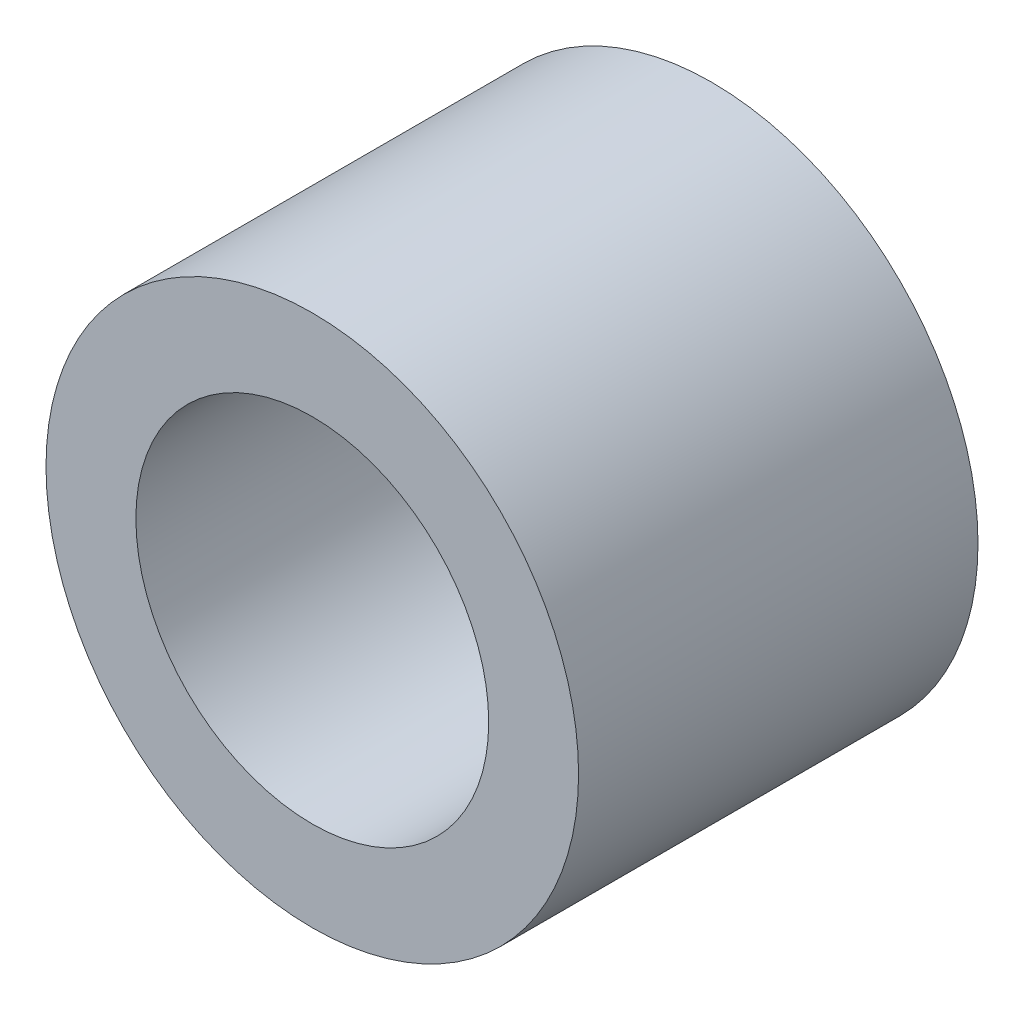
ISO-10303-21;
HEADER;
FILE_DESCRIPTION(('STEP AP214'),'2;1');
FILE_NAME('part.step','',(''),(''),'','','');
FILE_SCHEMA(('AUTOMOTIVE_DESIGN { 1 0 10303 214 1 1 1 1 }'));
ENDSEC;
DATA;
#1=APPLICATION_CONTEXT('core data for automotive mechanical design processes');
#2=APPLICATION_PROTOCOL_DEFINITION('international standard','automotive_design',2000,#1);
#3=PRODUCT_CONTEXT('',#1,'mechanical');
#4=PRODUCT('Part','Part','',(#3));
#5=PRODUCT_RELATED_PRODUCT_CATEGORY('part','',(#4));
#6=PRODUCT_DEFINITION_FORMATION('','',#4);
#7=PRODUCT_DEFINITION_CONTEXT('part definition',#1,'design');
#8=PRODUCT_DEFINITION('design','',#6,#7);
#9=PRODUCT_DEFINITION_SHAPE('','',#8);
#10=(LENGTH_UNIT() NAMED_UNIT(*) SI_UNIT(.MILLI.,.METRE.));
#11=(NAMED_UNIT(*) PLANE_ANGLE_UNIT() SI_UNIT($,.RADIAN.));
#12=(NAMED_UNIT(*) SI_UNIT($,.STERADIAN.) SOLID_ANGLE_UNIT());
#13=UNCERTAINTY_MEASURE_WITH_UNIT(LENGTH_MEASURE(1.E-05),#10,'distance_accuracy_value','');
#14=(GEOMETRIC_REPRESENTATION_CONTEXT(3) GLOBAL_UNCERTAINTY_ASSIGNED_CONTEXT((#13)) GLOBAL_UNIT_ASSIGNED_CONTEXT((#10,
#11,#12)) REPRESENTATION_CONTEXT('',''));
#15=CARTESIAN_POINT('',(0.,0.,0.));
#16=DIRECTION('',(0.,0.,1.));
#17=DIRECTION('',(1.,0.,0.));
#18=AXIS2_PLACEMENT_3D('',#15,#16,#17);
#19=CARTESIAN_POINT('',(0.,0.,3.));
#20=DIRECTION('',(0.,0.,1.));
#21=DIRECTION('',(1.,0.,0.));
#22=AXIS2_PLACEMENT_3D('',#19,#20,#21);
#23=PLANE('',#22);
#24=CARTESIAN_POINT('',(0.,0.,3.));
#25=DIRECTION('',(0.,0.,1.));
#26=DIRECTION('',(1.,0.,0.));
#27=AXIS2_PLACEMENT_3D('',#24,#25,#26);
#28=CIRCLE('',#27,4.);
#29=CARTESIAN_POINT('',(4.,0.,3.));
#30=VERTEX_POINT('',#29);
#31=EDGE_CURVE('E10',#30,#30,#28,.T.);
#32=ORIENTED_EDGE('',*,*,#31,.T.);
#33=EDGE_LOOP('',(#32));
#34=FACE_BOUND('',#33,.T.);
#35=CARTESIAN_POINT('',(0.,0.,3.));
#36=DIRECTION('',(0.,0.,1.));
#37=DIRECTION('',(1.,0.,0.));
#38=AXIS2_PLACEMENT_3D('',#35,#36,#37);
#39=CIRCLE('',#38,2.65);
#40=CARTESIAN_POINT('',(2.65,0.,3.));
#41=VERTEX_POINT('',#40);
#42=EDGE_CURVE('E37',#41,#41,#39,.T.);
#43=ORIENTED_EDGE('',*,*,#42,.F.);
#44=EDGE_LOOP('',(#43));
#45=FACE_BOUND('',#44,.T.);
#46=ADVANCED_FACE('F30',(#34,#45),#23,.T.);
#47=CARTESIAN_POINT('',(0.,0.,3.));
#48=DIRECTION('',(0.,0.,-1.));
#49=DIRECTION('',(-1.,0.,0.));
#50=AXIS2_PLACEMENT_3D('',#47,#48,#49);
#51=CYLINDRICAL_SURFACE('',#50,4.);
#52=ORIENTED_EDGE('',*,*,#31,.F.);
#53=EDGE_LOOP('',(#52));
#54=FACE_BOUND('',#53,.T.);
#55=CARTESIAN_POINT('',(0.,0.,-3.));
#56=DIRECTION('',(0.,0.,1.));
#57=DIRECTION('',(1.,0.,0.));
#58=AXIS2_PLACEMENT_3D('',#55,#56,#57);
#59=CIRCLE('',#58,4.);
#60=CARTESIAN_POINT('',(4.,0.,-3.));
#61=VERTEX_POINT('',#60);
#62=EDGE_CURVE('E41',#61,#61,#59,.T.);
#63=ORIENTED_EDGE('',*,*,#62,.T.);
#64=EDGE_LOOP('',(#63));
#65=FACE_BOUND('',#64,.T.);
#66=ADVANCED_FACE('F32',(#54,#65),#51,.T.);
#67=CARTESIAN_POINT('',(0.,0.,3.));
#68=DIRECTION('',(0.,0.,-1.));
#69=DIRECTION('',(-1.,0.,0.));
#70=AXIS2_PLACEMENT_3D('',#67,#68,#69);
#71=CYLINDRICAL_SURFACE('',#70,2.65);
#72=ORIENTED_EDGE('',*,*,#42,.T.);
#73=EDGE_LOOP('',(#72));
#74=FACE_BOUND('',#73,.T.);
#75=CARTESIAN_POINT('',(0.,0.,-3.));
#76=DIRECTION('',(0.,0.,1.));
#77=DIRECTION('',(1.,0.,0.));
#78=AXIS2_PLACEMENT_3D('',#75,#76,#77);
#79=CIRCLE('',#78,2.65);
#80=CARTESIAN_POINT('',(2.65,0.,-3.));
#81=VERTEX_POINT('',#80);
#82=EDGE_CURVE('E45',#81,#81,#79,.T.);
#83=ORIENTED_EDGE('',*,*,#82,.F.);
#84=EDGE_LOOP('',(#83));
#85=FACE_BOUND('',#84,.T.);
#86=ADVANCED_FACE('F54',(#74,#85),#71,.F.);
#87=CARTESIAN_POINT('',(0.,0.,-3.));
#88=DIRECTION('',(0.,0.,1.));
#89=DIRECTION('',(1.,0.,0.));
#90=AXIS2_PLACEMENT_3D('',#87,#88,#89);
#91=PLANE('',#90);
#92=ORIENTED_EDGE('',*,*,#82,.T.);
#93=EDGE_LOOP('',(#92));
#94=FACE_BOUND('',#93,.T.);
#95=ORIENTED_EDGE('',*,*,#62,.F.);
#96=EDGE_LOOP('',(#95));
#97=FACE_BOUND('',#96,.T.);
#98=ADVANCED_FACE('F51',(#94,#97),#91,.F.);
#99=CLOSED_SHELL('',(#46,#66,#86,#98));
#100=MANIFOLD_SOLID_BREP('B2',#99);
#101=ADVANCED_BREP_SHAPE_REPRESENTATION('',(#18,#100),#14);
#102=SHAPE_DEFINITION_REPRESENTATION(#9,#101);
ENDSEC;
END-ISO-10303-21;
